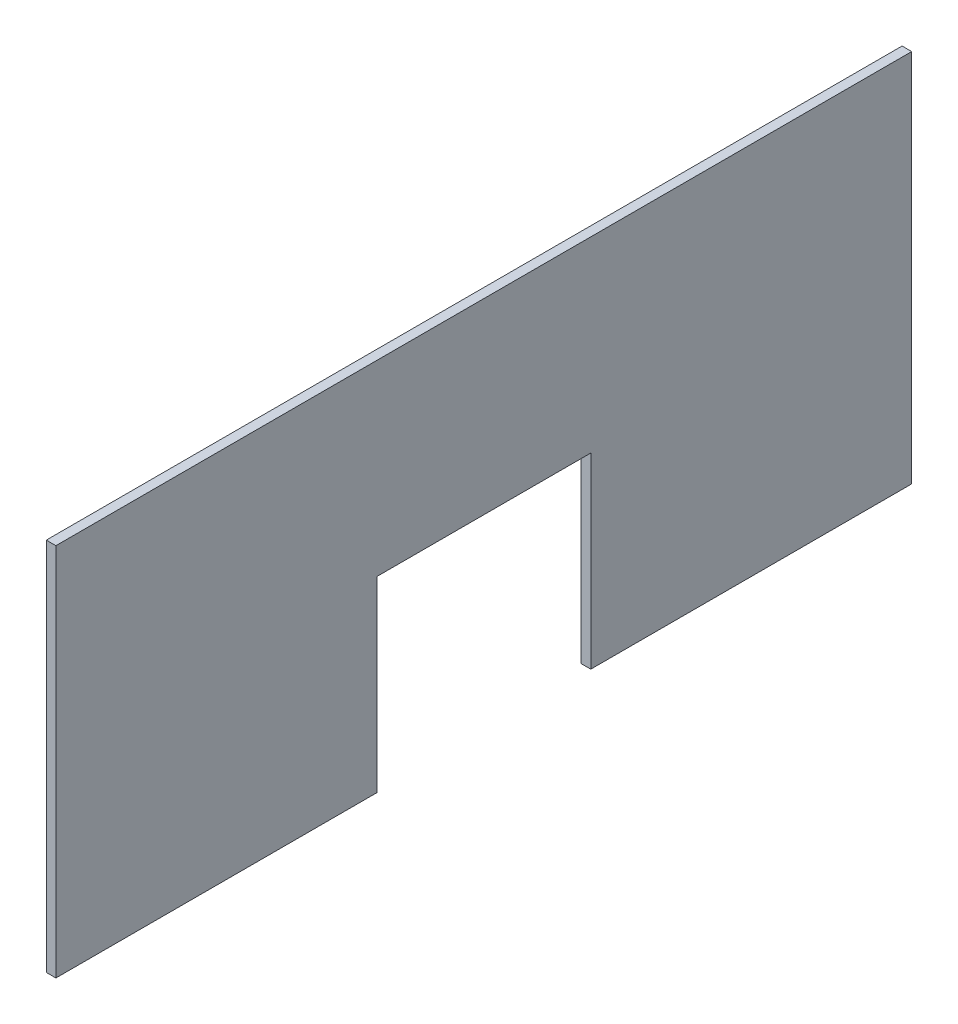
ISO-10303-21;
HEADER;
FILE_DESCRIPTION(('STEP AP214'),'2;1');
FILE_NAME('part.step','',(''),(''),'','','');
FILE_SCHEMA(('AUTOMOTIVE_DESIGN { 1 0 10303 214 1 1 1 1 }'));
ENDSEC;
DATA;
#1=APPLICATION_CONTEXT('core data for automotive mechanical design processes');
#2=APPLICATION_PROTOCOL_DEFINITION('international standard','automotive_design',2000,#1);
#3=PRODUCT_CONTEXT('',#1,'mechanical');
#4=PRODUCT('Part','Part','',(#3));
#5=PRODUCT_RELATED_PRODUCT_CATEGORY('part','',(#4));
#6=PRODUCT_DEFINITION_FORMATION('','',#4);
#7=PRODUCT_DEFINITION_CONTEXT('part definition',#1,'design');
#8=PRODUCT_DEFINITION('design','',#6,#7);
#9=PRODUCT_DEFINITION_SHAPE('','',#8);
#10=(LENGTH_UNIT() NAMED_UNIT(*) SI_UNIT(.MILLI.,.METRE.));
#11=(NAMED_UNIT(*) PLANE_ANGLE_UNIT() SI_UNIT($,.RADIAN.));
#12=(NAMED_UNIT(*) SI_UNIT($,.STERADIAN.) SOLID_ANGLE_UNIT());
#13=UNCERTAINTY_MEASURE_WITH_UNIT(LENGTH_MEASURE(1.E-05),#10,'distance_accuracy_value','');
#14=(GEOMETRIC_REPRESENTATION_CONTEXT(3) GLOBAL_UNCERTAINTY_ASSIGNED_CONTEXT((#13)) GLOBAL_UNIT_ASSIGNED_CONTEXT((#10,
#11,#12)) REPRESENTATION_CONTEXT('',''));
#15=CARTESIAN_POINT('',(0.,0.,0.));
#16=DIRECTION('',(0.,0.,1.));
#17=DIRECTION('',(1.,0.,0.));
#18=AXIS2_PLACEMENT_3D('',#15,#16,#17);
#19=CARTESIAN_POINT('',(18.,1580.39514592434,-1632.6817887917));
#20=DIRECTION('',(0.,-1.,0.));
#21=DIRECTION('',(0.,0.,-1.));
#22=AXIS2_PLACEMENT_3D('',#19,#20,#21);
#23=PLANE('',#22);
#24=DIRECTION('',(0.,0.,1.));
#25=VECTOR('',#24,1.);
#26=CARTESIAN_POINT('',(0.,1580.39514592434,-1632.6817887917));
#27=LINE('',#26,#25);
#28=CARTESIAN_POINT('',(0.,1580.39514592434,-1632.6817887917));
#29=VERTEX_POINT('',#28);
#30=CARTESIAN_POINT('',(0.,1580.39514592434,-32.6817887917042));
#31=VERTEX_POINT('',#30);
#32=EDGE_CURVE('E131',#29,#31,#27,.T.);
#33=ORIENTED_EDGE('',*,*,#32,.T.);
#34=DIRECTION('',(-1.,0.,0.));
#35=VECTOR('',#34,1.);
#36=CARTESIAN_POINT('',(18.,1580.39514592434,-32.6817887917042));
#37=LINE('',#36,#35);
#38=CARTESIAN_POINT('',(18.,1580.39514592434,-32.6817887917042));
#39=VERTEX_POINT('',#38);
#40=EDGE_CURVE('E11',#39,#31,#37,.T.);
#41=ORIENTED_EDGE('',*,*,#40,.F.);
#42=DIRECTION('',(0.,0.,1.));
#43=VECTOR('',#42,1.);
#44=CARTESIAN_POINT('',(18.,1580.39514592434,-1632.6817887917));
#45=LINE('',#44,#43);
#46=CARTESIAN_POINT('',(18.,1580.39514592434,-1632.6817887917));
#47=VERTEX_POINT('',#46);
#48=EDGE_CURVE('E145',#47,#39,#45,.T.);
#49=ORIENTED_EDGE('',*,*,#48,.F.);
#50=DIRECTION('',(-1.,0.,0.));
#51=VECTOR('',#50,1.);
#52=CARTESIAN_POINT('',(18.,1580.39514592434,-1632.6817887917));
#53=LINE('',#52,#51);
#54=EDGE_CURVE('E127',#47,#29,#53,.T.);
#55=ORIENTED_EDGE('',*,*,#54,.T.);
#56=EDGE_LOOP('',(#33,#41,#49,#55));
#57=FACE_BOUND('',#56,.T.);
#58=ADVANCED_FACE('F35',(#57),#23,.F.);
#59=CARTESIAN_POINT('',(18.,1580.39514592434,-32.6817887917042));
#60=DIRECTION('',(0.,0.,-1.));
#61=DIRECTION('',(0.,1.,0.));
#62=AXIS2_PLACEMENT_3D('',#59,#60,#61);
#63=PLANE('',#62);
#64=DIRECTION('',(0.,-1.,0.));
#65=VECTOR('',#64,1.);
#66=CARTESIAN_POINT('',(0.,1580.39514592434,-32.6817887917042));
#67=LINE('',#66,#65);
#68=CARTESIAN_POINT('',(0.,880.395145924344,-32.6817887917042));
#69=VERTEX_POINT('',#68);
#70=EDGE_CURVE('E134',#31,#69,#67,.T.);
#71=ORIENTED_EDGE('',*,*,#70,.T.);
#72=DIRECTION('',(-1.,0.,0.));
#73=VECTOR('',#72,1.);
#74=CARTESIAN_POINT('',(18.,880.395145924344,-32.6817887917042));
#75=LINE('',#74,#73);
#76=CARTESIAN_POINT('',(18.,880.395145924344,-32.6817887917042));
#77=VERTEX_POINT('',#76);
#78=EDGE_CURVE('E43',#77,#69,#75,.T.);
#79=ORIENTED_EDGE('',*,*,#78,.F.);
#80=DIRECTION('',(0.,-1.,0.));
#81=VECTOR('',#80,1.);
#82=CARTESIAN_POINT('',(18.,1580.39514592434,-32.6817887917042));
#83=LINE('',#82,#81);
#84=EDGE_CURVE('E94',#39,#77,#83,.T.);
#85=ORIENTED_EDGE('',*,*,#84,.F.);
#86=ORIENTED_EDGE('',*,*,#40,.T.);
#87=EDGE_LOOP('',(#71,#79,#85,#86));
#88=FACE_BOUND('',#87,.T.);
#89=ADVANCED_FACE('F180',(#88),#63,.F.);
#90=CARTESIAN_POINT('',(18.,880.395145924344,-32.6817887917042));
#91=DIRECTION('',(0.,1.,0.));
#92=DIRECTION('',(0.,0.,1.));
#93=AXIS2_PLACEMENT_3D('',#90,#91,#92);
#94=PLANE('',#93);
#95=DIRECTION('',(0.,0.,-1.));
#96=VECTOR('',#95,1.);
#97=CARTESIAN_POINT('',(0.,880.395145924344,-32.6817887917042));
#98=LINE('',#97,#96);
#99=CARTESIAN_POINT('',(0.,880.395145924344,-632.681788791704));
#100=VERTEX_POINT('',#99);
#101=EDGE_CURVE('E136',#69,#100,#98,.T.);
#102=ORIENTED_EDGE('',*,*,#101,.T.);
#103=DIRECTION('',(-1.,0.,0.));
#104=VECTOR('',#103,1.);
#105=CARTESIAN_POINT('',(18.,880.395145924344,-632.681788791704));
#106=LINE('',#105,#104);
#107=CARTESIAN_POINT('',(18.,880.395145924344,-632.681788791704));
#108=VERTEX_POINT('',#107);
#109=EDGE_CURVE('E152',#108,#100,#106,.T.);
#110=ORIENTED_EDGE('',*,*,#109,.F.);
#111=DIRECTION('',(0.,0.,-1.));
#112=VECTOR('',#111,1.);
#113=CARTESIAN_POINT('',(18.,880.395145924344,-32.6817887917042));
#114=LINE('',#113,#112);
#115=EDGE_CURVE('E160',#77,#108,#114,.T.);
#116=ORIENTED_EDGE('',*,*,#115,.F.);
#117=ORIENTED_EDGE('',*,*,#78,.T.);
#118=EDGE_LOOP('',(#102,#110,#116,#117));
#119=FACE_BOUND('',#118,.T.);
#120=ADVANCED_FACE('F158',(#119),#94,.F.);
#121=CARTESIAN_POINT('',(18.,880.395145924344,-632.681788791704));
#122=DIRECTION('',(0.,0.,1.));
#123=DIRECTION('',(1.,0.,0.));
#124=AXIS2_PLACEMENT_3D('',#121,#122,#123);
#125=PLANE('',#124);
#126=DIRECTION('',(0.,1.,0.));
#127=VECTOR('',#126,1.);
#128=CARTESIAN_POINT('',(0.,880.395145924344,-632.681788791704));
#129=LINE('',#128,#127);
#130=CARTESIAN_POINT('',(0.,1230.39514592434,-632.681788791704));
#131=VERTEX_POINT('',#130);
#132=EDGE_CURVE('E138',#100,#131,#129,.T.);
#133=ORIENTED_EDGE('',*,*,#132,.T.);
#134=DIRECTION('',(-1.,0.,0.));
#135=VECTOR('',#134,1.);
#136=CARTESIAN_POINT('',(18.,1230.39514592434,-632.681788791704));
#137=LINE('',#136,#135);
#138=CARTESIAN_POINT('',(18.,1230.39514592434,-632.681788791704));
#139=VERTEX_POINT('',#138);
#140=EDGE_CURVE('E149',#139,#131,#137,.T.);
#141=ORIENTED_EDGE('',*,*,#140,.F.);
#142=DIRECTION('',(0.,1.,0.));
#143=VECTOR('',#142,1.);
#144=CARTESIAN_POINT('',(18.,880.395145924344,-632.681788791704));
#145=LINE('',#144,#143);
#146=EDGE_CURVE('E172',#108,#139,#145,.T.);
#147=ORIENTED_EDGE('',*,*,#146,.F.);
#148=ORIENTED_EDGE('',*,*,#109,.T.);
#149=EDGE_LOOP('',(#133,#141,#147,#148));
#150=FACE_BOUND('',#149,.T.);
#151=ADVANCED_FACE('F168',(#150),#125,.F.);
#152=CARTESIAN_POINT('',(18.,1230.39514592434,-632.681788791704));
#153=DIRECTION('',(0.,1.,0.));
#154=DIRECTION('',(0.,0.,1.));
#155=AXIS2_PLACEMENT_3D('',#152,#153,#154);
#156=PLANE('',#155);
#157=DIRECTION('',(0.,0.,-1.));
#158=VECTOR('',#157,1.);
#159=CARTESIAN_POINT('',(0.,1230.39514592434,-632.681788791704));
#160=LINE('',#159,#158);
#161=CARTESIAN_POINT('',(0.,1230.39514592434,-1032.6817887917));
#162=VERTEX_POINT('',#161);
#163=EDGE_CURVE('E140',#131,#162,#160,.T.);
#164=ORIENTED_EDGE('',*,*,#163,.T.);
#165=DIRECTION('',(-1.,0.,0.));
#166=VECTOR('',#165,1.);
#167=CARTESIAN_POINT('',(18.,1230.39514592434,-1032.6817887917));
#168=LINE('',#167,#166);
#169=CARTESIAN_POINT('',(18.,1230.39514592434,-1032.6817887917));
#170=VERTEX_POINT('',#169);
#171=EDGE_CURVE('E122',#170,#162,#168,.T.);
#172=ORIENTED_EDGE('',*,*,#171,.F.);
#173=DIRECTION('',(0.,0.,-1.));
#174=VECTOR('',#173,1.);
#175=CARTESIAN_POINT('',(18.,1230.39514592434,-632.681788791704));
#176=LINE('',#175,#174);
#177=EDGE_CURVE('E113',#139,#170,#176,.T.);
#178=ORIENTED_EDGE('',*,*,#177,.F.);
#179=ORIENTED_EDGE('',*,*,#140,.T.);
#180=EDGE_LOOP('',(#164,#172,#178,#179));
#181=FACE_BOUND('',#180,.T.);
#182=ADVANCED_FACE('F171',(#181),#156,.F.);
#183=CARTESIAN_POINT('',(18.,1230.39514592434,-1032.6817887917));
#184=DIRECTION('',(0.,0.,-1.));
#185=DIRECTION('',(0.,1.,0.));
#186=AXIS2_PLACEMENT_3D('',#183,#184,#185);
#187=PLANE('',#186);
#188=DIRECTION('',(0.,-1.,0.));
#189=VECTOR('',#188,1.);
#190=CARTESIAN_POINT('',(0.,1230.39514592434,-1032.6817887917));
#191=LINE('',#190,#189);
#192=CARTESIAN_POINT('',(0.,880.395145924344,-1032.6817887917));
#193=VERTEX_POINT('',#192);
#194=EDGE_CURVE('E121',#162,#193,#191,.T.);
#195=ORIENTED_EDGE('',*,*,#194,.T.);
#196=DIRECTION('',(-1.,0.,0.));
#197=VECTOR('',#196,1.);
#198=CARTESIAN_POINT('',(18.,880.395145924344,-1032.6817887917));
#199=LINE('',#198,#197);
#200=CARTESIAN_POINT('',(18.,880.395145924344,-1032.6817887917));
#201=VERTEX_POINT('',#200);
#202=EDGE_CURVE('E118',#201,#193,#199,.T.);
#203=ORIENTED_EDGE('',*,*,#202,.F.);
#204=DIRECTION('',(0.,-1.,0.));
#205=VECTOR('',#204,1.);
#206=CARTESIAN_POINT('',(18.,1230.39514592434,-1032.6817887917));
#207=LINE('',#206,#205);
#208=EDGE_CURVE('E107',#170,#201,#207,.T.);
#209=ORIENTED_EDGE('',*,*,#208,.F.);
#210=ORIENTED_EDGE('',*,*,#171,.T.);
#211=EDGE_LOOP('',(#195,#203,#209,#210));
#212=FACE_BOUND('',#211,.T.);
#213=ADVANCED_FACE('F119',(#212),#187,.F.);
#214=CARTESIAN_POINT('',(18.,880.395145924344,-1032.6817887917));
#215=DIRECTION('',(0.,1.,0.));
#216=DIRECTION('',(0.,0.,1.));
#217=AXIS2_PLACEMENT_3D('',#214,#215,#216);
#218=PLANE('',#217);
#219=DIRECTION('',(0.,0.,-1.));
#220=VECTOR('',#219,1.);
#221=CARTESIAN_POINT('',(0.,880.395145924344,-1032.6817887917));
#222=LINE('',#221,#220);
#223=CARTESIAN_POINT('',(0.,880.395145924344,-1632.6817887917));
#224=VERTEX_POINT('',#223);
#225=EDGE_CURVE('E80',#193,#224,#222,.T.);
#226=ORIENTED_EDGE('',*,*,#225,.T.);
#227=DIRECTION('',(-1.,0.,0.));
#228=VECTOR('',#227,1.);
#229=CARTESIAN_POINT('',(18.,880.395145924344,-1632.6817887917));
#230=LINE('',#229,#228);
#231=CARTESIAN_POINT('',(18.,880.395145924344,-1632.6817887917));
#232=VERTEX_POINT('',#231);
#233=EDGE_CURVE('E123',#232,#224,#230,.T.);
#234=ORIENTED_EDGE('',*,*,#233,.F.);
#235=DIRECTION('',(0.,0.,-1.));
#236=VECTOR('',#235,1.);
#237=CARTESIAN_POINT('',(18.,880.395145924344,-1032.6817887917));
#238=LINE('',#237,#236);
#239=EDGE_CURVE('E111',#201,#232,#238,.T.);
#240=ORIENTED_EDGE('',*,*,#239,.F.);
#241=ORIENTED_EDGE('',*,*,#202,.T.);
#242=EDGE_LOOP('',(#226,#234,#240,#241));
#243=FACE_BOUND('',#242,.T.);
#244=ADVANCED_FACE('F125',(#243),#218,.F.);
#245=CARTESIAN_POINT('',(18.,880.395145924344,-1632.6817887917));
#246=DIRECTION('',(0.,0.,1.));
#247=DIRECTION('',(1.,0.,0.));
#248=AXIS2_PLACEMENT_3D('',#245,#246,#247);
#249=PLANE('',#248);
#250=DIRECTION('',(0.,1.,0.));
#251=VECTOR('',#250,1.);
#252=CARTESIAN_POINT('',(0.,880.395145924344,-1632.6817887917));
#253=LINE('',#252,#251);
#254=EDGE_CURVE('E86',#224,#29,#253,.T.);
#255=ORIENTED_EDGE('',*,*,#254,.T.);
#256=ORIENTED_EDGE('',*,*,#54,.F.);
#257=DIRECTION('',(0.,1.,0.));
#258=VECTOR('',#257,1.);
#259=CARTESIAN_POINT('',(18.,880.395145924344,-1632.6817887917));
#260=LINE('',#259,#258);
#261=EDGE_CURVE('E51',#232,#47,#260,.T.);
#262=ORIENTED_EDGE('',*,*,#261,.F.);
#263=ORIENTED_EDGE('',*,*,#233,.T.);
#264=EDGE_LOOP('',(#255,#256,#262,#263));
#265=FACE_BOUND('',#264,.T.);
#266=ADVANCED_FACE('F196',(#265),#249,.F.);
#267=CARTESIAN_POINT('',(18.,0.,0.));
#268=DIRECTION('',(1.,0.,0.));
#269=DIRECTION('',(0.,0.,-1.));
#270=AXIS2_PLACEMENT_3D('',#267,#268,#269);
#271=PLANE('',#270);
#272=ORIENTED_EDGE('',*,*,#48,.T.);
#273=ORIENTED_EDGE('',*,*,#84,.T.);
#274=ORIENTED_EDGE('',*,*,#115,.T.);
#275=ORIENTED_EDGE('',*,*,#146,.T.);
#276=ORIENTED_EDGE('',*,*,#177,.T.);
#277=ORIENTED_EDGE('',*,*,#208,.T.);
#278=ORIENTED_EDGE('',*,*,#239,.T.);
#279=ORIENTED_EDGE('',*,*,#261,.T.);
#280=EDGE_LOOP('',(#272,#273,#274,#275,#276,#277,#278,#279));
#281=FACE_BOUND('',#280,.T.);
#282=ADVANCED_FACE('F109',(#281),#271,.T.);
#283=CARTESIAN_POINT('',(0.,0.,0.));
#284=DIRECTION('',(1.,0.,0.));
#285=DIRECTION('',(0.,0.,-1.));
#286=AXIS2_PLACEMENT_3D('',#283,#284,#285);
#287=PLANE('',#286);
#288=ORIENTED_EDGE('',*,*,#32,.F.);
#289=ORIENTED_EDGE('',*,*,#254,.F.);
#290=ORIENTED_EDGE('',*,*,#225,.F.);
#291=ORIENTED_EDGE('',*,*,#194,.F.);
#292=ORIENTED_EDGE('',*,*,#163,.F.);
#293=ORIENTED_EDGE('',*,*,#132,.F.);
#294=ORIENTED_EDGE('',*,*,#101,.F.);
#295=ORIENTED_EDGE('',*,*,#70,.F.);
#296=EDGE_LOOP('',(#288,#289,#290,#291,#292,#293,#294,#295));
#297=FACE_BOUND('',#296,.T.);
#298=ADVANCED_FACE('F164',(#297),#287,.F.);
#299=CLOSED_SHELL('',(#58,#89,#120,#151,#182,#213,#244,#266,#282,#298));
#300=MANIFOLD_SOLID_BREP('B2',#299);
#301=ADVANCED_BREP_SHAPE_REPRESENTATION('',(#18,#300),#14);
#302=SHAPE_DEFINITION_REPRESENTATION(#9,#301);
ENDSEC;
END-ISO-10303-21;
